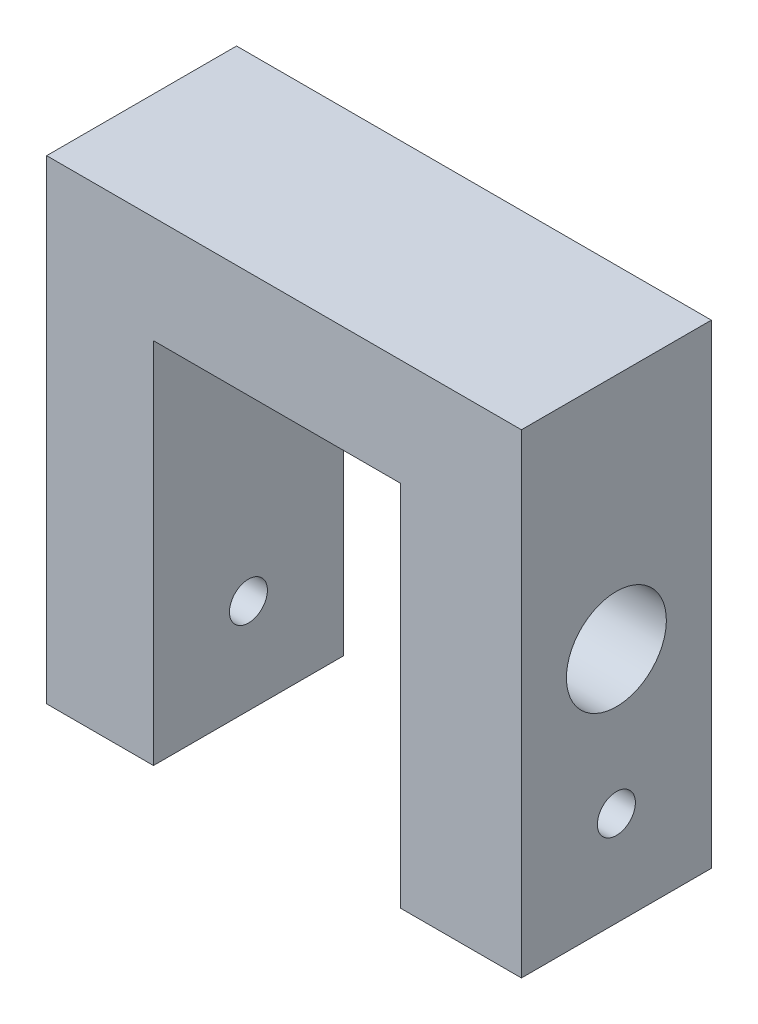
ISO-10303-21;
HEADER;
FILE_DESCRIPTION(('STEP AP214'),'2;1');
FILE_NAME('part.step','',(''),(''),'','','');
FILE_SCHEMA(('AUTOMOTIVE_DESIGN { 1 0 10303 214 1 1 1 1 }'));
ENDSEC;
DATA;
#1=APPLICATION_CONTEXT('core data for automotive mechanical design processes');
#2=APPLICATION_PROTOCOL_DEFINITION('international standard','automotive_design',2000,#1);
#3=PRODUCT_CONTEXT('',#1,'mechanical');
#4=PRODUCT('Part','Part','',(#3));
#5=PRODUCT_RELATED_PRODUCT_CATEGORY('part','',(#4));
#6=PRODUCT_DEFINITION_FORMATION('','',#4);
#7=PRODUCT_DEFINITION_CONTEXT('part definition',#1,'design');
#8=PRODUCT_DEFINITION('design','',#6,#7);
#9=PRODUCT_DEFINITION_SHAPE('','',#8);
#10=(LENGTH_UNIT() NAMED_UNIT(*) SI_UNIT(.MILLI.,.METRE.));
#11=(NAMED_UNIT(*) PLANE_ANGLE_UNIT() SI_UNIT($,.RADIAN.));
#12=(NAMED_UNIT(*) SI_UNIT($,.STERADIAN.) SOLID_ANGLE_UNIT());
#13=UNCERTAINTY_MEASURE_WITH_UNIT(LENGTH_MEASURE(1.E-05),#10,'distance_accuracy_value','');
#14=(GEOMETRIC_REPRESENTATION_CONTEXT(3) GLOBAL_UNCERTAINTY_ASSIGNED_CONTEXT((#13)) GLOBAL_UNIT_ASSIGNED_CONTEXT((#10,
#11,#12)) REPRESENTATION_CONTEXT('',''));
#15=CARTESIAN_POINT('',(0.,0.,0.));
#16=DIRECTION('',(0.,0.,1.));
#17=DIRECTION('',(1.,0.,0.));
#18=AXIS2_PLACEMENT_3D('',#15,#16,#17);
#19=CARTESIAN_POINT('',(-11.,-20.,16.));
#20=DIRECTION('',(0.,1.,0.));
#21=DIRECTION('',(0.,0.,1.));
#22=AXIS2_PLACEMENT_3D('',#19,#20,#21);
#23=PLANE('',#22);
#24=DIRECTION('',(1.,0.,0.));
#25=VECTOR('',#24,1.);
#26=CARTESIAN_POINT('',(-11.,-20.,0.));
#27=LINE('',#26,#25);
#28=CARTESIAN_POINT('',(-20.,-20.,0.));
#29=VERTEX_POINT('',#28);
#30=CARTESIAN_POINT('',(-11.,-20.,0.));
#31=VERTEX_POINT('',#30);
#32=EDGE_CURVE('E130',#29,#31,#27,.T.);
#33=ORIENTED_EDGE('',*,*,#32,.T.);
#34=DIRECTION('',(0.,0.,-1.));
#35=VECTOR('',#34,1.);
#36=CARTESIAN_POINT('',(-11.,-20.,16.));
#37=LINE('',#36,#35);
#38=CARTESIAN_POINT('',(-11.,-20.,16.));
#39=VERTEX_POINT('',#38);
#40=EDGE_CURVE('E11',#39,#31,#37,.T.);
#41=ORIENTED_EDGE('',*,*,#40,.F.);
#42=DIRECTION('',(1.,0.,0.));
#43=VECTOR('',#42,1.);
#44=CARTESIAN_POINT('',(-11.,-20.,16.));
#45=LINE('',#44,#43);
#46=CARTESIAN_POINT('',(-20.,-20.,16.));
#47=VERTEX_POINT('',#46);
#48=EDGE_CURVE('E145',#47,#39,#45,.T.);
#49=ORIENTED_EDGE('',*,*,#48,.F.);
#50=DIRECTION('',(0.,0.,-1.));
#51=VECTOR('',#50,1.);
#52=CARTESIAN_POINT('',(-20.,-20.,16.));
#53=LINE('',#52,#51);
#54=EDGE_CURVE('E126',#47,#29,#53,.T.);
#55=ORIENTED_EDGE('',*,*,#54,.T.);
#56=EDGE_LOOP('',(#33,#41,#49,#55));
#57=FACE_BOUND('',#56,.T.);
#58=ADVANCED_FACE('F34',(#57),#23,.F.);
#59=CARTESIAN_POINT('',(-11.,11.,16.));
#60=DIRECTION('',(-1.,0.,0.));
#61=DIRECTION('',(0.,0.,1.));
#62=AXIS2_PLACEMENT_3D('',#59,#60,#61);
#63=PLANE('',#62);
#64=CARTESIAN_POINT('',(-11.,-12.,8.));
#65=DIRECTION('',(-1.,0.,0.));
#66=DIRECTION('',(0.,0.,1.));
#67=AXIS2_PLACEMENT_3D('',#64,#65,#66);
#68=CIRCLE('',#67,1.6);
#69=CARTESIAN_POINT('',(-11.,-12.,9.6));
#70=VERTEX_POINT('',#69);
#71=EDGE_CURVE('E183',#70,#70,#68,.T.);
#72=ORIENTED_EDGE('',*,*,#71,.T.);
#73=EDGE_LOOP('',(#72));
#74=FACE_BOUND('',#73,.T.);
#75=DIRECTION('',(0.,1.,0.));
#76=VECTOR('',#75,1.);
#77=CARTESIAN_POINT('',(-11.,11.,0.));
#78=LINE('',#77,#76);
#79=CARTESIAN_POINT('',(-11.,11.,0.));
#80=VERTEX_POINT('',#79);
#81=EDGE_CURVE('E133',#31,#80,#78,.T.);
#82=ORIENTED_EDGE('',*,*,#81,.T.);
#83=DIRECTION('',(0.,0.,-1.));
#84=VECTOR('',#83,1.);
#85=CARTESIAN_POINT('',(-11.,11.,16.));
#86=LINE('',#85,#84);
#87=CARTESIAN_POINT('',(-11.,11.,16.));
#88=VERTEX_POINT('',#87);
#89=EDGE_CURVE('E42',#88,#80,#86,.T.);
#90=ORIENTED_EDGE('',*,*,#89,.F.);
#91=DIRECTION('',(0.,1.,0.));
#92=VECTOR('',#91,1.);
#93=CARTESIAN_POINT('',(-11.,11.,16.));
#94=LINE('',#93,#92);
#95=EDGE_CURVE('E93',#39,#88,#94,.T.);
#96=ORIENTED_EDGE('',*,*,#95,.F.);
#97=ORIENTED_EDGE('',*,*,#40,.T.);
#98=EDGE_LOOP('',(#82,#90,#96,#97));
#99=FACE_BOUND('',#98,.T.);
#100=ADVANCED_FACE('F206',(#74,#99),#63,.F.);
#101=CARTESIAN_POINT('',(9.8,11.,16.));
#102=DIRECTION('',(0.,1.,0.));
#103=DIRECTION('',(-1.,0.,0.));
#104=AXIS2_PLACEMENT_3D('',#101,#102,#103);
#105=PLANE('',#104);
#106=DIRECTION('',(1.,0.,0.));
#107=VECTOR('',#106,1.);
#108=CARTESIAN_POINT('',(9.8,11.,0.));
#109=LINE('',#108,#107);
#110=CARTESIAN_POINT('',(9.8,11.,0.));
#111=VERTEX_POINT('',#110);
#112=EDGE_CURVE('E136',#80,#111,#109,.T.);
#113=ORIENTED_EDGE('',*,*,#112,.T.);
#114=DIRECTION('',(0.,0.,-1.));
#115=VECTOR('',#114,1.);
#116=CARTESIAN_POINT('',(9.8,11.,16.));
#117=LINE('',#116,#115);
#118=CARTESIAN_POINT('',(9.8,11.,16.));
#119=VERTEX_POINT('',#118);
#120=EDGE_CURVE('E152',#119,#111,#117,.T.);
#121=ORIENTED_EDGE('',*,*,#120,.F.);
#122=DIRECTION('',(1.,0.,0.));
#123=VECTOR('',#122,1.);
#124=CARTESIAN_POINT('',(9.8,11.,16.));
#125=LINE('',#124,#123);
#126=EDGE_CURVE('E160',#88,#119,#125,.T.);
#127=ORIENTED_EDGE('',*,*,#126,.F.);
#128=ORIENTED_EDGE('',*,*,#89,.T.);
#129=EDGE_LOOP('',(#113,#121,#127,#128));
#130=FACE_BOUND('',#129,.T.);
#131=ADVANCED_FACE('F158',(#130),#105,.F.);
#132=CARTESIAN_POINT('',(9.8,-20.,16.));
#133=DIRECTION('',(1.,0.,0.));
#134=DIRECTION('',(0.,0.,-1.));
#135=AXIS2_PLACEMENT_3D('',#132,#133,#134);
#136=PLANE('',#135);
#137=CARTESIAN_POINT('',(9.8,-12.,8.));
#138=DIRECTION('',(1.,0.,0.));
#139=DIRECTION('',(0.,0.,-1.));
#140=AXIS2_PLACEMENT_3D('',#137,#138,#139);
#141=CIRCLE('',#140,1.6);
#142=CARTESIAN_POINT('',(9.8,-12.,6.4));
#143=VERTEX_POINT('',#142);
#144=EDGE_CURVE('E186',#143,#143,#141,.T.);
#145=ORIENTED_EDGE('',*,*,#144,.T.);
#146=EDGE_LOOP('',(#145));
#147=FACE_BOUND('',#146,.T.);
#148=CARTESIAN_POINT('',(9.8,0.,8.));
#149=DIRECTION('',(1.,0.,0.));
#150=DIRECTION('',(0.,0.,-1.));
#151=AXIS2_PLACEMENT_3D('',#148,#149,#150);
#152=CIRCLE('',#151,4.21);
#153=CARTESIAN_POINT('',(9.8,0.,3.79));
#154=VERTEX_POINT('',#153);
#155=EDGE_CURVE('E134',#154,#154,#152,.T.);
#156=ORIENTED_EDGE('',*,*,#155,.T.);
#157=EDGE_LOOP('',(#156));
#158=FACE_BOUND('',#157,.T.);
#159=DIRECTION('',(0.,-1.,0.));
#160=VECTOR('',#159,1.);
#161=CARTESIAN_POINT('',(9.8,-20.,0.));
#162=LINE('',#161,#160);
#163=CARTESIAN_POINT('',(9.8,-20.,0.));
#164=VERTEX_POINT('',#163);
#165=EDGE_CURVE('E138',#111,#164,#162,.T.);
#166=ORIENTED_EDGE('',*,*,#165,.T.);
#167=DIRECTION('',(0.,0.,-1.));
#168=VECTOR('',#167,1.);
#169=CARTESIAN_POINT('',(9.8,-20.,16.));
#170=LINE('',#169,#168);
#171=CARTESIAN_POINT('',(9.8,-20.,16.));
#172=VERTEX_POINT('',#171);
#173=EDGE_CURVE('E149',#172,#164,#170,.T.);
#174=ORIENTED_EDGE('',*,*,#173,.F.);
#175=DIRECTION('',(0.,-1.,0.));
#176=VECTOR('',#175,1.);
#177=CARTESIAN_POINT('',(9.8,-20.,16.));
#178=LINE('',#177,#176);
#179=EDGE_CURVE('E172',#119,#172,#178,.T.);
#180=ORIENTED_EDGE('',*,*,#179,.F.);
#181=ORIENTED_EDGE('',*,*,#120,.T.);
#182=EDGE_LOOP('',(#166,#174,#180,#181));
#183=FACE_BOUND('',#182,.T.);
#184=ADVANCED_FACE('F168',(#147,#158,#183),#136,.F.);
#185=CARTESIAN_POINT('',(20.,-20.,16.));
#186=DIRECTION('',(0.,1.,0.));
#187=DIRECTION('',(0.,0.,1.));
#188=AXIS2_PLACEMENT_3D('',#185,#186,#187);
#189=PLANE('',#188);
#190=DIRECTION('',(1.,0.,0.));
#191=VECTOR('',#190,1.);
#192=CARTESIAN_POINT('',(20.,-20.,0.));
#193=LINE('',#192,#191);
#194=CARTESIAN_POINT('',(20.,-20.,0.));
#195=VERTEX_POINT('',#194);
#196=EDGE_CURVE('E140',#164,#195,#193,.T.);
#197=ORIENTED_EDGE('',*,*,#196,.T.);
#198=DIRECTION('',(0.,0.,-1.));
#199=VECTOR('',#198,1.);
#200=CARTESIAN_POINT('',(20.,-20.,16.));
#201=LINE('',#200,#199);
#202=CARTESIAN_POINT('',(20.,-20.,16.));
#203=VERTEX_POINT('',#202);
#204=EDGE_CURVE('E121',#203,#195,#201,.T.);
#205=ORIENTED_EDGE('',*,*,#204,.F.);
#206=DIRECTION('',(1.,0.,0.));
#207=VECTOR('',#206,1.);
#208=CARTESIAN_POINT('',(20.,-20.,16.));
#209=LINE('',#208,#207);
#210=EDGE_CURVE('E112',#172,#203,#209,.T.);
#211=ORIENTED_EDGE('',*,*,#210,.F.);
#212=ORIENTED_EDGE('',*,*,#173,.T.);
#213=EDGE_LOOP('',(#197,#205,#211,#212));
#214=FACE_BOUND('',#213,.T.);
#215=ADVANCED_FACE('F171',(#214),#189,.F.);
#216=CARTESIAN_POINT('',(20.,20.,16.));
#217=DIRECTION('',(-1.,0.,0.));
#218=DIRECTION('',(0.,-1.,0.));
#219=AXIS2_PLACEMENT_3D('',#216,#217,#218);
#220=PLANE('',#219);
#221=CARTESIAN_POINT('',(20.,-12.,8.));
#222=DIRECTION('',(1.,0.,0.));
#223=DIRECTION('',(0.,1.,0.));
#224=AXIS2_PLACEMENT_3D('',#221,#222,#223);
#225=CIRCLE('',#224,1.6);
#226=CARTESIAN_POINT('',(20.,-10.4,8.));
#227=VERTEX_POINT('',#226);
#228=EDGE_CURVE('E190',#227,#227,#225,.T.);
#229=ORIENTED_EDGE('',*,*,#228,.F.);
#230=EDGE_LOOP('',(#229));
#231=FACE_BOUND('',#230,.T.);
#232=CARTESIAN_POINT('',(20.,0.,8.));
#233=DIRECTION('',(1.,0.,0.));
#234=DIRECTION('',(0.,1.,0.));
#235=AXIS2_PLACEMENT_3D('',#232,#233,#234);
#236=CIRCLE('',#235,4.21);
#237=CARTESIAN_POINT('',(20.,4.21000000000001,8.));
#238=VERTEX_POINT('',#237);
#239=EDGE_CURVE('E180',#238,#238,#236,.T.);
#240=ORIENTED_EDGE('',*,*,#239,.F.);
#241=EDGE_LOOP('',(#240));
#242=FACE_BOUND('',#241,.T.);
#243=DIRECTION('',(0.,1.,0.));
#244=VECTOR('',#243,1.);
#245=CARTESIAN_POINT('',(20.,20.,0.));
#246=LINE('',#245,#244);
#247=CARTESIAN_POINT('',(20.,20.,0.));
#248=VERTEX_POINT('',#247);
#249=EDGE_CURVE('E120',#195,#248,#246,.T.);
#250=ORIENTED_EDGE('',*,*,#249,.T.);
#251=DIRECTION('',(0.,0.,-1.));
#252=VECTOR('',#251,1.);
#253=CARTESIAN_POINT('',(20.,20.,16.));
#254=LINE('',#253,#252);
#255=CARTESIAN_POINT('',(20.,20.,16.));
#256=VERTEX_POINT('',#255);
#257=EDGE_CURVE('E117',#256,#248,#254,.T.);
#258=ORIENTED_EDGE('',*,*,#257,.F.);
#259=DIRECTION('',(0.,1.,0.));
#260=VECTOR('',#259,1.);
#261=CARTESIAN_POINT('',(20.,20.,16.));
#262=LINE('',#261,#260);
#263=EDGE_CURVE('E106',#203,#256,#262,.T.);
#264=ORIENTED_EDGE('',*,*,#263,.F.);
#265=ORIENTED_EDGE('',*,*,#204,.T.);
#266=EDGE_LOOP('',(#250,#258,#264,#265));
#267=FACE_BOUND('',#266,.T.);
#268=ADVANCED_FACE('F118',(#231,#242,#267),#220,.F.);
#269=CARTESIAN_POINT('',(-20.,20.,16.));
#270=DIRECTION('',(0.,-1.,0.));
#271=DIRECTION('',(0.,0.,-1.));
#272=AXIS2_PLACEMENT_3D('',#269,#270,#271);
#273=PLANE('',#272);
#274=DIRECTION('',(-1.,0.,0.));
#275=VECTOR('',#274,1.);
#276=CARTESIAN_POINT('',(-20.,20.,0.));
#277=LINE('',#276,#275);
#278=CARTESIAN_POINT('',(-20.,20.,0.));
#279=VERTEX_POINT('',#278);
#280=EDGE_CURVE('E79',#248,#279,#277,.T.);
#281=ORIENTED_EDGE('',*,*,#280,.T.);
#282=DIRECTION('',(0.,0.,-1.));
#283=VECTOR('',#282,1.);
#284=CARTESIAN_POINT('',(-20.,20.,16.));
#285=LINE('',#284,#283);
#286=CARTESIAN_POINT('',(-20.,20.,16.));
#287=VERTEX_POINT('',#286);
#288=EDGE_CURVE('E122',#287,#279,#285,.T.);
#289=ORIENTED_EDGE('',*,*,#288,.F.);
#290=DIRECTION('',(-1.,0.,0.));
#291=VECTOR('',#290,1.);
#292=CARTESIAN_POINT('',(-20.,20.,16.));
#293=LINE('',#292,#291);
#294=EDGE_CURVE('E110',#256,#287,#293,.T.);
#295=ORIENTED_EDGE('',*,*,#294,.F.);
#296=ORIENTED_EDGE('',*,*,#257,.T.);
#297=EDGE_LOOP('',(#281,#289,#295,#296));
#298=FACE_BOUND('',#297,.T.);
#299=ADVANCED_FACE('F124',(#298),#273,.F.);
#300=CARTESIAN_POINT('',(-20.,-20.,16.));
#301=DIRECTION('',(1.,0.,0.));
#302=DIRECTION('',(0.,0.,-1.));
#303=AXIS2_PLACEMENT_3D('',#300,#301,#302);
#304=PLANE('',#303);
#305=CARTESIAN_POINT('',(-20.,-12.,8.));
#306=DIRECTION('',(1.,0.,0.));
#307=DIRECTION('',(0.,1.,0.));
#308=AXIS2_PLACEMENT_3D('',#305,#306,#307);
#309=CIRCLE('',#308,1.6);
#310=CARTESIAN_POINT('',(-20.,-10.4,8.));
#311=VERTEX_POINT('',#310);
#312=EDGE_CURVE('E189',#311,#311,#309,.T.);
#313=ORIENTED_EDGE('',*,*,#312,.T.);
#314=EDGE_LOOP('',(#313));
#315=FACE_BOUND('',#314,.T.);
#316=DIRECTION('',(0.,-1.,0.));
#317=VECTOR('',#316,1.);
#318=CARTESIAN_POINT('',(-20.,-20.,0.));
#319=LINE('',#318,#317);
#320=EDGE_CURVE('E85',#279,#29,#319,.T.);
#321=ORIENTED_EDGE('',*,*,#320,.T.);
#322=ORIENTED_EDGE('',*,*,#54,.F.);
#323=DIRECTION('',(0.,-1.,0.));
#324=VECTOR('',#323,1.);
#325=CARTESIAN_POINT('',(-20.,-20.,16.));
#326=LINE('',#325,#324);
#327=EDGE_CURVE('E50',#287,#47,#326,.T.);
#328=ORIENTED_EDGE('',*,*,#327,.F.);
#329=ORIENTED_EDGE('',*,*,#288,.T.);
#330=EDGE_LOOP('',(#321,#322,#328,#329));
#331=FACE_BOUND('',#330,.T.);
#332=ADVANCED_FACE('F196',(#315,#331),#304,.F.);
#333=CARTESIAN_POINT('',(0.,0.,16.));
#334=DIRECTION('',(0.,0.,-1.));
#335=DIRECTION('',(-1.,0.,0.));
#336=AXIS2_PLACEMENT_3D('',#333,#334,#335);
#337=PLANE('',#336);
#338=ORIENTED_EDGE('',*,*,#48,.T.);
#339=ORIENTED_EDGE('',*,*,#95,.T.);
#340=ORIENTED_EDGE('',*,*,#126,.T.);
#341=ORIENTED_EDGE('',*,*,#179,.T.);
#342=ORIENTED_EDGE('',*,*,#210,.T.);
#343=ORIENTED_EDGE('',*,*,#263,.T.);
#344=ORIENTED_EDGE('',*,*,#294,.T.);
#345=ORIENTED_EDGE('',*,*,#327,.T.);
#346=EDGE_LOOP('',(#338,#339,#340,#341,#342,#343,#344,#345));
#347=FACE_BOUND('',#346,.T.);
#348=ADVANCED_FACE('F108',(#347),#337,.F.);
#349=CARTESIAN_POINT('',(0.,0.,0.));
#350=DIRECTION('',(0.,0.,-1.));
#351=DIRECTION('',(-1.,0.,0.));
#352=AXIS2_PLACEMENT_3D('',#349,#350,#351);
#353=PLANE('',#352);
#354=ORIENTED_EDGE('',*,*,#32,.F.);
#355=ORIENTED_EDGE('',*,*,#320,.F.);
#356=ORIENTED_EDGE('',*,*,#280,.F.);
#357=ORIENTED_EDGE('',*,*,#249,.F.);
#358=ORIENTED_EDGE('',*,*,#196,.F.);
#359=ORIENTED_EDGE('',*,*,#165,.F.);
#360=ORIENTED_EDGE('',*,*,#112,.F.);
#361=ORIENTED_EDGE('',*,*,#81,.F.);
#362=EDGE_LOOP('',(#354,#355,#356,#357,#358,#359,#360,#361));
#363=FACE_BOUND('',#362,.T.);
#364=ADVANCED_FACE('F164',(#363),#353,.T.);
#365=CARTESIAN_POINT('',(9.00000000000001,0.,8.));
#366=DIRECTION('',(1.,0.,0.));
#367=DIRECTION('',(0.,1.,0.));
#368=AXIS2_PLACEMENT_3D('',#365,#366,#367);
#369=CYLINDRICAL_SURFACE('',#368,4.21);
#370=ORIENTED_EDGE('',*,*,#239,.T.);
#371=EDGE_LOOP('',(#370));
#372=FACE_BOUND('',#371,.T.);
#373=ORIENTED_EDGE('',*,*,#155,.F.);
#374=EDGE_LOOP('',(#373));
#375=FACE_BOUND('',#374,.T.);
#376=ADVANCED_FACE('F202',(#372,#375),#369,.F.);
#377=CARTESIAN_POINT('',(-20.,-12.,8.));
#378=DIRECTION('',(1.,0.,0.));
#379=DIRECTION('',(0.,1.,0.));
#380=AXIS2_PLACEMENT_3D('',#377,#378,#379);
#381=CYLINDRICAL_SURFACE('',#380,1.6);
#382=ORIENTED_EDGE('',*,*,#312,.F.);
#383=EDGE_LOOP('',(#382));
#384=FACE_BOUND('',#383,.T.);
#385=ORIENTED_EDGE('',*,*,#71,.F.);
#386=EDGE_LOOP('',(#385));
#387=FACE_BOUND('',#386,.T.);
#388=ADVANCED_FACE('F198',(#384,#387),#381,.F.);
#389=ORIENTED_EDGE('',*,*,#228,.T.);
#390=EDGE_LOOP('',(#389));
#391=FACE_BOUND('',#390,.T.);
#392=ORIENTED_EDGE('',*,*,#144,.F.);
#393=EDGE_LOOP('',(#392));
#394=FACE_BOUND('',#393,.T.);
#395=ADVANCED_FACE('F201',(#391,#394),#381,.F.);
#396=CLOSED_SHELL('',(#58,#100,#131,#184,#215,#268,#299,#332,#348,#364,#376,#388,#395));
#397=MANIFOLD_SOLID_BREP('B2',#396);
#398=ADVANCED_BREP_SHAPE_REPRESENTATION('',(#18,#397),#14);
#399=SHAPE_DEFINITION_REPRESENTATION(#9,#398);
ENDSEC;
END-ISO-10303-21;
